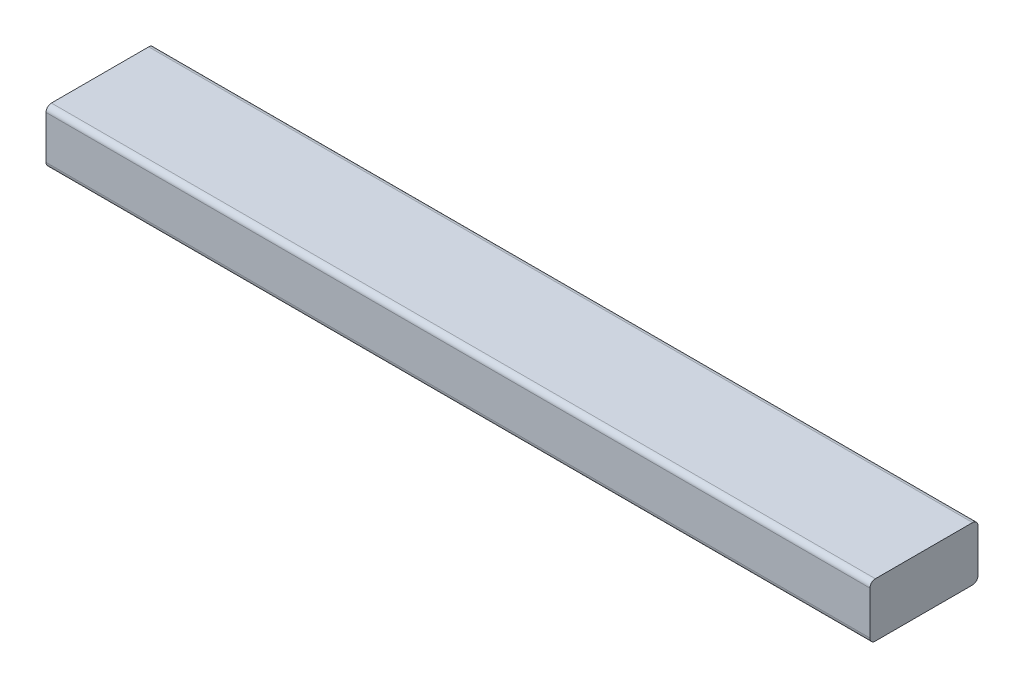
ISO-10303-21;
HEADER;
FILE_DESCRIPTION(('STEP AP214'),'2;1');
FILE_NAME('part.step','',(''),(''),'','','');
FILE_SCHEMA(('AUTOMOTIVE_DESIGN { 1 0 10303 214 1 1 1 1 }'));
ENDSEC;
DATA;
#1=APPLICATION_CONTEXT('core data for automotive mechanical design processes');
#2=APPLICATION_PROTOCOL_DEFINITION('international standard','automotive_design',2000,#1);
#3=PRODUCT_CONTEXT('',#1,'mechanical');
#4=PRODUCT('Part','Part','',(#3));
#5=PRODUCT_RELATED_PRODUCT_CATEGORY('part','',(#4));
#6=PRODUCT_DEFINITION_FORMATION('','',#4);
#7=PRODUCT_DEFINITION_CONTEXT('part definition',#1,'design');
#8=PRODUCT_DEFINITION('design','',#6,#7);
#9=PRODUCT_DEFINITION_SHAPE('','',#8);
#10=(LENGTH_UNIT() NAMED_UNIT(*) SI_UNIT(.MILLI.,.METRE.));
#11=(NAMED_UNIT(*) PLANE_ANGLE_UNIT() SI_UNIT($,.RADIAN.));
#12=(NAMED_UNIT(*) SI_UNIT($,.STERADIAN.) SOLID_ANGLE_UNIT());
#13=UNCERTAINTY_MEASURE_WITH_UNIT(LENGTH_MEASURE(1.E-05),#10,'distance_accuracy_value','');
#14=(GEOMETRIC_REPRESENTATION_CONTEXT(3) GLOBAL_UNCERTAINTY_ASSIGNED_CONTEXT((#13)) GLOBAL_UNIT_ASSIGNED_CONTEXT((#10,
#11,#12)) REPRESENTATION_CONTEXT('',''));
#15=CARTESIAN_POINT('',(0.,0.,0.));
#16=DIRECTION('',(0.,0.,1.));
#17=DIRECTION('',(1.,0.,0.));
#18=AXIS2_PLACEMENT_3D('',#15,#16,#17);
#19=CARTESIAN_POINT('',(2587.29999999996,38.1000000000078,160.700000000008));
#20=DIRECTION('',(1.,0.,0.));
#21=DIRECTION('',(0.,1.,0.));
#22=AXIS2_PLACEMENT_3D('',#19,#20,#21);
#23=PLANE('',#22);
#24=DIRECTION('',(0.,0.,1.));
#25=VECTOR('',#24,1.);
#26=CARTESIAN_POINT('',(2587.29999999996,38.1000000000078,160.700000000008));
#27=LINE('',#26,#25);
#28=CARTESIAN_POINT('',(2587.29999999996,38.1000000000079,165.780000000008));
#29=VERTEX_POINT('',#28);
#30=CARTESIAN_POINT('',(2587.29999999996,38.1000000000096,257.220000000008));
#31=VERTEX_POINT('',#30);
#32=EDGE_CURVE('E131',#29,#31,#27,.T.);
#33=ORIENTED_EDGE('',*,*,#32,.T.);
#34=CARTESIAN_POINT('',(2587.29999999996,33.0200000000096,257.220000000008));
#35=DIRECTION('',(1.,0.,0.));
#36=DIRECTION('',(0.,1.,0.));
#37=AXIS2_PLACEMENT_3D('',#34,#35,#36);
#38=CIRCLE('',#37,5.08);
#39=CARTESIAN_POINT('',(2587.29999999996,33.0200000000097,262.300000000008));
#40=VERTEX_POINT('',#39);
#41=EDGE_CURVE('E126',#31,#40,#38,.T.);
#42=ORIENTED_EDGE('',*,*,#41,.T.);
#43=DIRECTION('',(0.,-1.,0.));
#44=VECTOR('',#43,1.);
#45=CARTESIAN_POINT('',(2587.29999999996,38.1000000000097,262.300000000008));
#46=LINE('',#45,#44);
#47=CARTESIAN_POINT('',(2587.29999999996,-7.61999999999032,262.300000000009));
#48=VERTEX_POINT('',#47);
#49=EDGE_CURVE('E128',#40,#48,#46,.T.);
#50=ORIENTED_EDGE('',*,*,#49,.T.);
#51=CARTESIAN_POINT('',(2587.29999999996,-7.61999999999042,257.220000000009));
#52=DIRECTION('',(1.,0.,0.));
#53=DIRECTION('',(0.,1.,0.));
#54=AXIS2_PLACEMENT_3D('',#51,#52,#53);
#55=CIRCLE('',#54,5.08);
#56=CARTESIAN_POINT('',(2587.29999999996,-12.6999999999904,257.220000000009));
#57=VERTEX_POINT('',#56);
#58=EDGE_CURVE('E137',#48,#57,#55,.T.);
#59=ORIENTED_EDGE('',*,*,#58,.T.);
#60=DIRECTION('',(0.,0.,1.));
#61=VECTOR('',#60,1.);
#62=CARTESIAN_POINT('',(2587.29999999996,-12.6999999999922,160.700000000009));
#63=LINE('',#62,#61);
#64=CARTESIAN_POINT('',(2587.29999999996,-12.6999999999921,165.780000000009));
#65=VERTEX_POINT('',#64);
#66=EDGE_CURVE('E209',#65,#57,#63,.T.);
#67=ORIENTED_EDGE('',*,*,#66,.F.);
#68=CARTESIAN_POINT('',(2587.29999999996,-7.61999999999207,165.780000000009));
#69=DIRECTION('',(1.,0.,0.));
#70=DIRECTION('',(0.,1.,0.));
#71=AXIS2_PLACEMENT_3D('',#68,#69,#70);
#72=CIRCLE('',#71,5.08);
#73=CARTESIAN_POINT('',(2587.29999999996,-7.61999999999216,160.700000000009));
#74=VERTEX_POINT('',#73);
#75=EDGE_CURVE('E66',#65,#74,#72,.T.);
#76=ORIENTED_EDGE('',*,*,#75,.T.);
#77=DIRECTION('',(0.,-1.,0.));
#78=VECTOR('',#77,1.);
#79=CARTESIAN_POINT('',(2587.29999999996,38.1000000000078,160.700000000008));
#80=LINE('',#79,#78);
#81=CARTESIAN_POINT('',(2587.29999999996,33.0200000000078,160.700000000008));
#82=VERTEX_POINT('',#81);
#83=EDGE_CURVE('E160',#82,#74,#80,.T.);
#84=ORIENTED_EDGE('',*,*,#83,.F.);
#85=CARTESIAN_POINT('',(2587.29999999996,33.0200000000079,165.780000000008));
#86=DIRECTION('',(1.,0.,0.));
#87=DIRECTION('',(0.,1.,0.));
#88=AXIS2_PLACEMENT_3D('',#85,#86,#87);
#89=CIRCLE('',#88,5.08);
#90=EDGE_CURVE('E75',#82,#29,#89,.T.);
#91=ORIENTED_EDGE('',*,*,#90,.T.);
#92=EDGE_LOOP('',(#33,#42,#50,#59,#67,#76,#84,#91));
#93=FACE_BOUND('',#92,.T.);
#94=ADVANCED_FACE('F47',(#93),#23,.T.);
#95=CARTESIAN_POINT('',(2587.29999999996,38.1000000000078,160.700000000008));
#96=DIRECTION('',(0.,0.,-1.));
#97=DIRECTION('',(0.,1.,0.));
#98=AXIS2_PLACEMENT_3D('',#95,#96,#97);
#99=PLANE('',#98);
#100=DIRECTION('',(0.,-1.,0.));
#101=VECTOR('',#100,1.);
#102=CARTESIAN_POINT('',(1812.69999999996,38.1000000000038,160.700000000008));
#103=LINE('',#102,#101);
#104=CARTESIAN_POINT('',(1812.69999999996,33.0200000000038,160.700000000008));
#105=VERTEX_POINT('',#104);
#106=CARTESIAN_POINT('',(1812.69999999996,-7.61999999999621,160.700000000009));
#107=VERTEX_POINT('',#106);
#108=EDGE_CURVE('E194',#105,#107,#103,.T.);
#109=ORIENTED_EDGE('',*,*,#108,.F.);
#110=DIRECTION('',(1.,0.,0.));
#111=VECTOR('',#110,1.);
#112=CARTESIAN_POINT('',(2587.29999999996,33.0200000000078,160.700000000008));
#113=LINE('',#112,#111);
#114=EDGE_CURVE('E11',#105,#82,#113,.T.);
#115=ORIENTED_EDGE('',*,*,#114,.T.);
#116=ORIENTED_EDGE('',*,*,#83,.T.);
#117=DIRECTION('',(1.,0.,0.));
#118=VECTOR('',#117,1.);
#119=CARTESIAN_POINT('',(2587.29999999996,-7.61999999999216,160.700000000009));
#120=LINE('',#119,#118);
#121=EDGE_CURVE('E56',#74,#107,#120,.F.);
#122=ORIENTED_EDGE('',*,*,#121,.T.);
#123=EDGE_LOOP('',(#109,#115,#116,#122));
#124=FACE_BOUND('',#123,.T.);
#125=ADVANCED_FACE('F193',(#124),#99,.T.);
#126=CARTESIAN_POINT('',(1812.69999999996,38.1000000000038,160.700000000008));
#127=DIRECTION('',(-1.,0.,0.));
#128=DIRECTION('',(0.,-1.,0.));
#129=AXIS2_PLACEMENT_3D('',#126,#127,#128);
#130=PLANE('',#129);
#131=DIRECTION('',(0.,-1.,0.));
#132=VECTOR('',#131,1.);
#133=CARTESIAN_POINT('',(1812.69999999996,38.1000000000056,262.300000000008));
#134=LINE('',#133,#132);
#135=CARTESIAN_POINT('',(1812.69999999996,33.0200000000056,262.300000000008));
#136=VERTEX_POINT('',#135);
#137=CARTESIAN_POINT('',(1812.69999999996,-7.61999999999437,262.300000000009));
#138=VERTEX_POINT('',#137);
#139=EDGE_CURVE('E148',#136,#138,#134,.T.);
#140=ORIENTED_EDGE('',*,*,#139,.F.);
#141=CARTESIAN_POINT('',(1812.69999999996,33.0200000000055,257.220000000008));
#142=DIRECTION('',(-1.,0.,0.));
#143=DIRECTION('',(0.,-1.,0.));
#144=AXIS2_PLACEMENT_3D('',#141,#142,#143);
#145=CIRCLE('',#144,5.08);
#146=CARTESIAN_POINT('',(1812.69999999996,38.1000000000055,257.220000000008));
#147=VERTEX_POINT('',#146);
#148=EDGE_CURVE('E152',#136,#147,#145,.T.);
#149=ORIENTED_EDGE('',*,*,#148,.T.);
#150=DIRECTION('',(0.,0.,-1.));
#151=VECTOR('',#150,1.);
#152=CARTESIAN_POINT('',(1812.69999999996,38.1000000000038,160.700000000008));
#153=LINE('',#152,#151);
#154=CARTESIAN_POINT('',(1812.69999999996,38.1000000000039,165.780000000008));
#155=VERTEX_POINT('',#154);
#156=EDGE_CURVE('E149',#147,#155,#153,.T.);
#157=ORIENTED_EDGE('',*,*,#156,.T.);
#158=CARTESIAN_POINT('',(1812.69999999996,33.0200000000039,165.780000000008));
#159=DIRECTION('',(-1.,0.,0.));
#160=DIRECTION('',(0.,-1.,0.));
#161=AXIS2_PLACEMENT_3D('',#158,#159,#160);
#162=CIRCLE('',#161,5.08);
#163=EDGE_CURVE('E158',#155,#105,#162,.T.);
#164=ORIENTED_EDGE('',*,*,#163,.T.);
#165=ORIENTED_EDGE('',*,*,#108,.T.);
#166=CARTESIAN_POINT('',(1812.69999999996,-7.61999999999612,165.780000000009));
#167=DIRECTION('',(-1.,0.,0.));
#168=DIRECTION('',(0.,-1.,0.));
#169=AXIS2_PLACEMENT_3D('',#166,#167,#168);
#170=CIRCLE('',#169,5.08);
#171=CARTESIAN_POINT('',(1812.69999999996,-12.6999999999961,165.780000000009));
#172=VERTEX_POINT('',#171);
#173=EDGE_CURVE('E154',#107,#172,#170,.T.);
#174=ORIENTED_EDGE('',*,*,#173,.T.);
#175=DIRECTION('',(0.,0.,-1.));
#176=VECTOR('',#175,1.);
#177=CARTESIAN_POINT('',(1812.69999999996,-12.6999999999962,160.700000000009));
#178=LINE('',#177,#176);
#179=CARTESIAN_POINT('',(1812.69999999996,-12.6999999999945,257.220000000009));
#180=VERTEX_POINT('',#179);
#181=EDGE_CURVE('E211',#180,#172,#178,.T.);
#182=ORIENTED_EDGE('',*,*,#181,.F.);
#183=CARTESIAN_POINT('',(1812.69999999996,-7.61999999999447,257.220000000009));
#184=DIRECTION('',(-1.,0.,0.));
#185=DIRECTION('',(0.,-1.,0.));
#186=AXIS2_PLACEMENT_3D('',#183,#184,#185);
#187=CIRCLE('',#186,5.08);
#188=EDGE_CURVE('E165',#180,#138,#187,.T.);
#189=ORIENTED_EDGE('',*,*,#188,.T.);
#190=EDGE_LOOP('',(#140,#149,#157,#164,#165,#174,#182,#189));
#191=FACE_BOUND('',#190,.T.);
#192=ADVANCED_FACE('F198',(#191),#130,.T.);
#193=CARTESIAN_POINT('',(2587.29999999996,38.1000000000097,262.300000000008));
#194=DIRECTION('',(0.,0.,1.));
#195=DIRECTION('',(0.,-1.,0.));
#196=AXIS2_PLACEMENT_3D('',#193,#194,#195);
#197=PLANE('',#196);
#198=ORIENTED_EDGE('',*,*,#49,.F.);
#199=DIRECTION('',(-1.,0.,0.));
#200=VECTOR('',#199,1.);
#201=CARTESIAN_POINT('',(1812.69999999996,33.0200000000056,262.300000000008));
#202=LINE('',#201,#200);
#203=EDGE_CURVE('E143',#40,#136,#202,.T.);
#204=ORIENTED_EDGE('',*,*,#203,.T.);
#205=ORIENTED_EDGE('',*,*,#139,.T.);
#206=DIRECTION('',(-1.,0.,0.));
#207=VECTOR('',#206,1.);
#208=CARTESIAN_POINT('',(2587.29999999996,-7.61999999999032,262.300000000009));
#209=LINE('',#208,#207);
#210=EDGE_CURVE('E146',#138,#48,#209,.F.);
#211=ORIENTED_EDGE('',*,*,#210,.T.);
#212=EDGE_LOOP('',(#198,#204,#205,#211));
#213=FACE_BOUND('',#212,.T.);
#214=ADVANCED_FACE('F141',(#213),#197,.T.);
#215=CARTESIAN_POINT('',(-1.99199760780075E-13,38.0999999999914,-6.88847661806863E-13));
#216=DIRECTION('',(0.,-1.,0.));
#217=DIRECTION('',(0.,0.,-1.));
#218=AXIS2_PLACEMENT_3D('',#215,#216,#217);
#219=PLANE('',#218);
#220=ORIENTED_EDGE('',*,*,#156,.F.);
#221=DIRECTION('',(-1.,0.,0.));
#222=VECTOR('',#221,1.);
#223=CARTESIAN_POINT('',(2587.29999999996,38.1000000000096,257.220000000008));
#224=LINE('',#223,#222);
#225=EDGE_CURVE('E173',#147,#31,#224,.F.);
#226=ORIENTED_EDGE('',*,*,#225,.T.);
#227=ORIENTED_EDGE('',*,*,#32,.F.);
#228=DIRECTION('',(1.,0.,0.));
#229=VECTOR('',#228,1.);
#230=CARTESIAN_POINT('',(1812.69999999996,38.1000000000039,165.780000000008));
#231=LINE('',#230,#229);
#232=EDGE_CURVE('E170',#29,#155,#231,.F.);
#233=ORIENTED_EDGE('',*,*,#232,.T.);
#234=EDGE_LOOP('',(#220,#226,#227,#233));
#235=FACE_BOUND('',#234,.T.);
#236=ADVANCED_FACE('F241',(#235),#219,.F.);
#237=CARTESIAN_POINT('',(0.,-12.7000000000086,2.29634020132585E-13));
#238=DIRECTION('',(0.,-1.,0.));
#239=DIRECTION('',(0.,0.,-1.));
#240=AXIS2_PLACEMENT_3D('',#237,#238,#239);
#241=PLANE('',#240);
#242=ORIENTED_EDGE('',*,*,#66,.T.);
#243=DIRECTION('',(-1.,0.,0.));
#244=VECTOR('',#243,1.);
#245=CARTESIAN_POINT('',(0.,-12.7000000000039,257.220000000009));
#246=LINE('',#245,#244);
#247=EDGE_CURVE('E185',#57,#180,#246,.T.);
#248=ORIENTED_EDGE('',*,*,#247,.T.);
#249=ORIENTED_EDGE('',*,*,#181,.T.);
#250=DIRECTION('',(1.,0.,0.));
#251=VECTOR('',#250,1.);
#252=CARTESIAN_POINT('',(0.,-12.7000000000056,165.780000000009));
#253=LINE('',#252,#251);
#254=EDGE_CURVE('E136',#172,#65,#253,.T.);
#255=ORIENTED_EDGE('',*,*,#254,.T.);
#256=EDGE_LOOP('',(#242,#248,#249,#255));
#257=FACE_BOUND('',#256,.T.);
#258=ADVANCED_FACE('F208',(#257),#241,.T.);
#259=CARTESIAN_POINT('',(2587.29999999996,33.0200000000096,257.220000000008));
#260=DIRECTION('',(1.,0.,0.));
#261=DIRECTION('',(0.,1.,0.));
#262=AXIS2_PLACEMENT_3D('',#259,#260,#261);
#263=CYLINDRICAL_SURFACE('',#262,5.08);
#264=ORIENTED_EDGE('',*,*,#41,.F.);
#265=ORIENTED_EDGE('',*,*,#225,.F.);
#266=ORIENTED_EDGE('',*,*,#148,.F.);
#267=ORIENTED_EDGE('',*,*,#203,.F.);
#268=EDGE_LOOP('',(#264,#265,#266,#267));
#269=FACE_BOUND('',#268,.T.);
#270=ADVANCED_FACE('F151',(#269),#263,.T.);
#271=CARTESIAN_POINT('',(0.,-7.62000000000395,257.220000000009));
#272=DIRECTION('',(-1.,0.,0.));
#273=DIRECTION('',(0.,-1.,0.));
#274=AXIS2_PLACEMENT_3D('',#271,#272,#273);
#275=CYLINDRICAL_SURFACE('',#274,5.08);
#276=ORIENTED_EDGE('',*,*,#58,.F.);
#277=ORIENTED_EDGE('',*,*,#210,.F.);
#278=ORIENTED_EDGE('',*,*,#188,.F.);
#279=ORIENTED_EDGE('',*,*,#247,.F.);
#280=EDGE_LOOP('',(#276,#277,#278,#279));
#281=FACE_BOUND('',#280,.T.);
#282=ADVANCED_FACE('F223',(#281),#275,.T.);
#283=CARTESIAN_POINT('',(2587.29999999996,33.0200000000079,165.780000000008));
#284=DIRECTION('',(-1.,0.,0.));
#285=DIRECTION('',(0.,-1.,0.));
#286=AXIS2_PLACEMENT_3D('',#283,#284,#285);
#287=CYLINDRICAL_SURFACE('',#286,5.08);
#288=ORIENTED_EDGE('',*,*,#163,.F.);
#289=ORIENTED_EDGE('',*,*,#232,.F.);
#290=ORIENTED_EDGE('',*,*,#90,.F.);
#291=ORIENTED_EDGE('',*,*,#114,.F.);
#292=EDGE_LOOP('',(#288,#289,#290,#291));
#293=FACE_BOUND('',#292,.T.);
#294=ADVANCED_FACE('F225',(#293),#287,.T.);
#295=CARTESIAN_POINT('',(0.,-7.6200000000056,165.780000000009));
#296=DIRECTION('',(1.,0.,0.));
#297=DIRECTION('',(0.,1.,0.));
#298=AXIS2_PLACEMENT_3D('',#295,#296,#297);
#299=CYLINDRICAL_SURFACE('',#298,5.08);
#300=ORIENTED_EDGE('',*,*,#173,.F.);
#301=ORIENTED_EDGE('',*,*,#121,.F.);
#302=ORIENTED_EDGE('',*,*,#75,.F.);
#303=ORIENTED_EDGE('',*,*,#254,.F.);
#304=EDGE_LOOP('',(#300,#301,#302,#303));
#305=FACE_BOUND('',#304,.T.);
#306=ADVANCED_FACE('F49',(#305),#299,.T.);
#307=CLOSED_SHELL('',(#94,#125,#192,#214,#236,#258,#270,#282,#294,#306));
#308=MANIFOLD_SOLID_BREP('B2',#307);
#309=ADVANCED_BREP_SHAPE_REPRESENTATION('',(#18,#308),#14);
#310=SHAPE_DEFINITION_REPRESENTATION(#9,#309);
ENDSEC;
END-ISO-10303-21;
